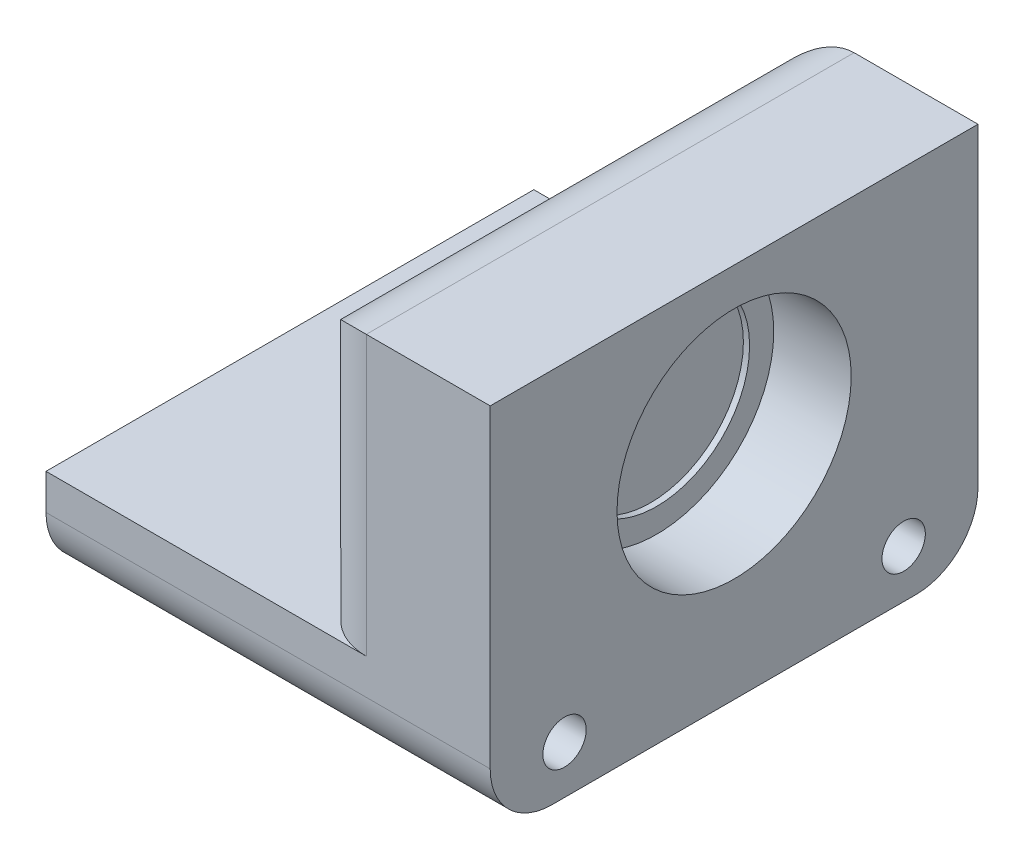
ISO-10303-21;
HEADER;
FILE_DESCRIPTION(('STEP AP214'),'2;1');
FILE_NAME('part.step','',(''),(''),'','','');
FILE_SCHEMA(('AUTOMOTIVE_DESIGN { 1 0 10303 214 1 1 1 1 }'));
ENDSEC;
DATA;
#1=APPLICATION_CONTEXT('core data for automotive mechanical design processes');
#2=APPLICATION_PROTOCOL_DEFINITION('international standard','automotive_design',2000,#1);
#3=PRODUCT_CONTEXT('',#1,'mechanical');
#4=PRODUCT('Part','Part','',(#3));
#5=PRODUCT_RELATED_PRODUCT_CATEGORY('part','',(#4));
#6=PRODUCT_DEFINITION_FORMATION('','',#4);
#7=PRODUCT_DEFINITION_CONTEXT('part definition',#1,'design');
#8=PRODUCT_DEFINITION('design','',#6,#7);
#9=PRODUCT_DEFINITION_SHAPE('','',#8);
#10=(LENGTH_UNIT() NAMED_UNIT(*) SI_UNIT(.MILLI.,.METRE.));
#11=(NAMED_UNIT(*) PLANE_ANGLE_UNIT() SI_UNIT($,.RADIAN.));
#12=(NAMED_UNIT(*) SI_UNIT($,.STERADIAN.) SOLID_ANGLE_UNIT());
#13=UNCERTAINTY_MEASURE_WITH_UNIT(LENGTH_MEASURE(1.E-05),#10,'distance_accuracy_value','');
#14=(GEOMETRIC_REPRESENTATION_CONTEXT(3) GLOBAL_UNCERTAINTY_ASSIGNED_CONTEXT((#13)) GLOBAL_UNIT_ASSIGNED_CONTEXT((#10,
#11,#12)) REPRESENTATION_CONTEXT('',''));
#15=CARTESIAN_POINT('',(0.,0.,0.));
#16=DIRECTION('',(0.,0.,1.));
#17=DIRECTION('',(1.,0.,0.));
#18=AXIS2_PLACEMENT_3D('',#15,#16,#17);
#19=CARTESIAN_POINT('',(-61.1504901312249,0.,-20.));
#20=DIRECTION('',(0.,1.,0.));
#21=DIRECTION('',(-1.,0.,0.));
#22=AXIS2_PLACEMENT_3D('',#19,#20,#21);
#23=PLANE('',#22);
#24=DIRECTION('',(-1.,0.,0.));
#25=VECTOR('',#24,1.);
#26=CARTESIAN_POINT('',(-61.1504901312249,0.,0.));
#27=LINE('',#26,#25);
#28=CARTESIAN_POINT('',(-58.6104901312249,0.,0.));
#29=VERTEX_POINT('',#28);
#30=CARTESIAN_POINT('',(-71.742285041225,0.,0.));
#31=VERTEX_POINT('',#30);
#32=EDGE_CURVE('E152',#29,#31,#27,.T.);
#33=ORIENTED_EDGE('',*,*,#32,.F.);
#34=CARTESIAN_POINT('',(-58.6104901312249,0.,-2.54));
#35=DIRECTION('',(0.,1.,0.));
#36=DIRECTION('',(-1.,0.,0.));
#37=AXIS2_PLACEMENT_3D('',#34,#35,#36);
#38=CIRCLE('',#37,2.54);
#39=CARTESIAN_POINT('',(-61.1504901312249,0.,-2.54));
#40=VERTEX_POINT('',#39);
#41=EDGE_CURVE('E11',#29,#40,#38,.F.);
#42=ORIENTED_EDGE('',*,*,#41,.T.);
#43=DIRECTION('',(0.,0.,1.));
#44=VECTOR('',#43,1.);
#45=CARTESIAN_POINT('',(-61.1504901312249,0.,-20.));
#46=LINE('',#45,#44);
#47=CARTESIAN_POINT('',(-61.1504901312249,0.,-17.46));
#48=VERTEX_POINT('',#47);
#49=EDGE_CURVE('E157',#48,#40,#46,.T.);
#50=ORIENTED_EDGE('',*,*,#49,.F.);
#51=CARTESIAN_POINT('',(-58.6104901312249,0.,-17.46));
#52=DIRECTION('',(0.,1.,0.));
#53=DIRECTION('',(-1.,0.,0.));
#54=AXIS2_PLACEMENT_3D('',#51,#52,#53);
#55=CIRCLE('',#54,2.54);
#56=CARTESIAN_POINT('',(-58.6104901312249,0.,-20.));
#57=VERTEX_POINT('',#56);
#58=EDGE_CURVE('E42',#48,#57,#55,.F.);
#59=ORIENTED_EDGE('',*,*,#58,.T.);
#60=DIRECTION('',(-1.,0.,0.));
#61=VECTOR('',#60,1.);
#62=CARTESIAN_POINT('',(-61.1504901312249,0.,-20.));
#63=LINE('',#62,#61);
#64=CARTESIAN_POINT('',(-71.742285041225,0.,-20.));
#65=VERTEX_POINT('',#64);
#66=EDGE_CURVE('E131',#57,#65,#63,.T.);
#67=ORIENTED_EDGE('',*,*,#66,.T.);
#68=DIRECTION('',(0.,0.,1.));
#69=VECTOR('',#68,1.);
#70=CARTESIAN_POINT('',(-71.742285041225,0.,-20.));
#71=LINE('',#70,#69);
#72=EDGE_CURVE('E117',#65,#31,#71,.T.);
#73=ORIENTED_EDGE('',*,*,#72,.T.);
#74=EDGE_LOOP('',(#33,#42,#50,#59,#67,#73));
#75=FACE_BOUND('',#74,.T.);
#76=ADVANCED_FACE('F33',(#75),#23,.T.);
#77=CARTESIAN_POINT('',(-61.1504901312249,11.43,-20.));
#78=DIRECTION('',(-1.,0.,0.));
#79=DIRECTION('',(0.,0.,1.));
#80=AXIS2_PLACEMENT_3D('',#77,#78,#79);
#81=PLANE('',#80);
#82=DIRECTION('',(0.,0.,1.));
#83=VECTOR('',#82,1.);
#84=CARTESIAN_POINT('',(-61.1504901312249,8.88999999999999,-20.));
#85=LINE('',#84,#83);
#86=CARTESIAN_POINT('',(-61.1504901312249,8.88999999999999,-12.9205582274627));
#87=VERTEX_POINT('',#86);
#88=CARTESIAN_POINT('',(-61.1504901312249,8.88999999999999,-17.46));
#89=VERTEX_POINT('',#88);
#90=EDGE_CURVE('E170',#87,#89,#85,.F.);
#91=ORIENTED_EDGE('',*,*,#90,.T.);
#92=DIRECTION('',(0.,-1.,0.));
#93=VECTOR('',#92,1.);
#94=CARTESIAN_POINT('',(-61.1504901312249,0.,-17.46));
#95=LINE('',#94,#93);
#96=EDGE_CURVE('E172',#89,#48,#95,.T.);
#97=ORIENTED_EDGE('',*,*,#96,.T.);
#98=ORIENTED_EDGE('',*,*,#49,.T.);
#99=DIRECTION('',(0.,-1.,0.));
#100=VECTOR('',#99,1.);
#101=CARTESIAN_POINT('',(-61.1504901312249,11.43,-2.54));
#102=LINE('',#101,#100);
#103=CARTESIAN_POINT('',(-61.1504901312249,8.88999999999999,-2.54));
#104=VERTEX_POINT('',#103);
#105=EDGE_CURVE('E160',#40,#104,#102,.F.);
#106=ORIENTED_EDGE('',*,*,#105,.T.);
#107=DIRECTION('',(0.,0.,1.));
#108=VECTOR('',#107,1.);
#109=CARTESIAN_POINT('',(-61.1504901312249,8.88999999999999,-20.));
#110=LINE('',#109,#108);
#111=CARTESIAN_POINT('',(-61.1504901312249,8.88999999999999,-7.07944177253729));
#112=VERTEX_POINT('',#111);
#113=EDGE_CURVE('E168',#104,#112,#110,.F.);
#114=ORIENTED_EDGE('',*,*,#113,.T.);
#115=CARTESIAN_POINT('',(-61.1504901312249,5.08,-10.));
#116=DIRECTION('',(-1.,0.,0.));
#117=DIRECTION('',(0.,0.,1.));
#118=AXIS2_PLACEMENT_3D('',#115,#116,#117);
#119=CIRCLE('',#118,4.8006);
#120=EDGE_CURVE('E293',#87,#112,#119,.T.);
#121=ORIENTED_EDGE('',*,*,#120,.F.);
#122=EDGE_LOOP('',(#91,#97,#98,#106,#114,#121));
#123=FACE_BOUND('',#122,.T.);
#124=ADVANCED_FACE('F223',(#123),#81,.T.);
#125=CARTESIAN_POINT('',(-53.530479711225,11.43,-20.));
#126=DIRECTION('',(0.,1.,0.));
#127=DIRECTION('',(0.,0.,1.));
#128=AXIS2_PLACEMENT_3D('',#125,#126,#127);
#129=PLANE('',#128);
#130=DIRECTION('',(-1.,0.,0.));
#131=VECTOR('',#130,1.);
#132=CARTESIAN_POINT('',(-53.530479711225,11.43,-20.));
#133=LINE('',#132,#131);
#134=CARTESIAN_POINT('',(-53.530479711225,11.43,-20.));
#135=VERTEX_POINT('',#134);
#136=CARTESIAN_POINT('',(-58.6104901312249,11.43,-20.));
#137=VERTEX_POINT('',#136);
#138=EDGE_CURVE('E127',#135,#137,#133,.T.);
#139=ORIENTED_EDGE('',*,*,#138,.T.);
#140=DIRECTION('',(0.,0.,1.));
#141=VECTOR('',#140,1.);
#142=CARTESIAN_POINT('',(-58.6104901312249,11.43,-20.));
#143=LINE('',#142,#141);
#144=CARTESIAN_POINT('',(-58.6104901312249,11.43,0.));
#145=VERTEX_POINT('',#144);
#146=EDGE_CURVE('E178',#137,#145,#143,.T.);
#147=ORIENTED_EDGE('',*,*,#146,.T.);
#148=DIRECTION('',(-1.,0.,0.));
#149=VECTOR('',#148,1.);
#150=CARTESIAN_POINT('',(-53.530479711225,11.43,0.));
#151=LINE('',#150,#149);
#152=CARTESIAN_POINT('',(-53.530479711225,11.43,0.));
#153=VERTEX_POINT('',#152);
#154=EDGE_CURVE('E140',#153,#145,#151,.T.);
#155=ORIENTED_EDGE('',*,*,#154,.F.);
#156=DIRECTION('',(0.,0.,1.));
#157=VECTOR('',#156,1.);
#158=CARTESIAN_POINT('',(-53.530479711225,11.43,-20.));
#159=LINE('',#158,#157);
#160=EDGE_CURVE('E161',#135,#153,#159,.T.);
#161=ORIENTED_EDGE('',*,*,#160,.F.);
#162=EDGE_LOOP('',(#139,#147,#155,#161));
#163=FACE_BOUND('',#162,.T.);
#164=ADVANCED_FACE('F226',(#163),#129,.T.);
#165=CARTESIAN_POINT('',(-53.530479711225,-4.00000000000001,-20.));
#166=DIRECTION('',(1.,0.,0.));
#167=DIRECTION('',(0.,0.,-1.));
#168=AXIS2_PLACEMENT_3D('',#165,#166,#167);
#169=PLANE('',#168);
#170=CARTESIAN_POINT('',(-53.530479711225,-2.03200000000001,-16.952));
#171=DIRECTION('',(-1.,0.,0.));
#172=DIRECTION('',(0.,0.,1.));
#173=AXIS2_PLACEMENT_3D('',#170,#171,#172);
#174=CIRCLE('',#173,0.888999999999995);
#175=CARTESIAN_POINT('',(-53.530479711225,-2.03200000000001,-16.063));
#176=VERTEX_POINT('',#175);
#177=EDGE_CURVE('E346',#176,#176,#174,.T.);
#178=ORIENTED_EDGE('',*,*,#177,.T.);
#179=EDGE_LOOP('',(#178));
#180=FACE_BOUND('',#179,.T.);
#181=CARTESIAN_POINT('',(-53.530479711225,-2.03200000000001,-3.048));
#182=DIRECTION('',(-1.,0.,0.));
#183=DIRECTION('',(0.,0.,1.));
#184=AXIS2_PLACEMENT_3D('',#181,#182,#183);
#185=CIRCLE('',#184,0.888999999999995);
#186=CARTESIAN_POINT('',(-53.530479711225,-2.03200000000001,-2.159));
#187=VERTEX_POINT('',#186);
#188=EDGE_CURVE('E332',#187,#187,#185,.T.);
#189=ORIENTED_EDGE('',*,*,#188,.T.);
#190=EDGE_LOOP('',(#189));
#191=FACE_BOUND('',#190,.T.);
#192=CARTESIAN_POINT('',(-53.530479711225,5.08,-10.));
#193=DIRECTION('',(1.,0.,0.));
#194=DIRECTION('',(0.,0.,-1.));
#195=AXIS2_PLACEMENT_3D('',#192,#193,#194);
#196=CIRCLE('',#195,4.8006);
#197=CARTESIAN_POINT('',(-53.530479711225,5.08,-14.8006));
#198=VERTEX_POINT('',#197);
#199=EDGE_CURVE('E323',#198,#198,#196,.T.);
#200=ORIENTED_EDGE('',*,*,#199,.F.);
#201=EDGE_LOOP('',(#200));
#202=FACE_BOUND('',#201,.T.);
#203=DIRECTION('',(0.,1.,0.));
#204=VECTOR('',#203,1.);
#205=CARTESIAN_POINT('',(-53.530479711225,-4.00000000000001,0.));
#206=LINE('',#205,#204);
#207=CARTESIAN_POINT('',(-53.530479711225,-1.46000000000001,0.));
#208=VERTEX_POINT('',#207);
#209=EDGE_CURVE('E143',#208,#153,#206,.T.);
#210=ORIENTED_EDGE('',*,*,#209,.F.);
#211=CARTESIAN_POINT('',(-53.530479711225,-1.46000000000001,-2.54));
#212=DIRECTION('',(1.,0.,0.));
#213=DIRECTION('',(0.,0.,-1.));
#214=AXIS2_PLACEMENT_3D('',#211,#212,#213);
#215=CIRCLE('',#214,2.54);
#216=CARTESIAN_POINT('',(-53.530479711225,-4.00000000000001,-2.54));
#217=VERTEX_POINT('',#216);
#218=EDGE_CURVE('E270',#208,#217,#215,.T.);
#219=ORIENTED_EDGE('',*,*,#218,.T.);
#220=DIRECTION('',(0.,0.,1.));
#221=VECTOR('',#220,1.);
#222=CARTESIAN_POINT('',(-53.530479711225,-4.00000000000001,-20.));
#223=LINE('',#222,#221);
#224=CARTESIAN_POINT('',(-53.530479711225,-4.00000000000001,-17.46));
#225=VERTEX_POINT('',#224);
#226=EDGE_CURVE('E164',#225,#217,#223,.T.);
#227=ORIENTED_EDGE('',*,*,#226,.F.);
#228=CARTESIAN_POINT('',(-53.530479711225,-1.46000000000001,-17.46));
#229=DIRECTION('',(1.,0.,0.));
#230=DIRECTION('',(0.,0.,-1.));
#231=AXIS2_PLACEMENT_3D('',#228,#229,#230);
#232=CIRCLE('',#231,2.54);
#233=CARTESIAN_POINT('',(-53.530479711225,-1.46000000000001,-20.));
#234=VERTEX_POINT('',#233);
#235=EDGE_CURVE('E272',#225,#234,#232,.T.);
#236=ORIENTED_EDGE('',*,*,#235,.T.);
#237=DIRECTION('',(0.,1.,0.));
#238=VECTOR('',#237,1.);
#239=CARTESIAN_POINT('',(-53.530479711225,-4.00000000000001,-20.));
#240=LINE('',#239,#238);
#241=EDGE_CURVE('E136',#234,#135,#240,.T.);
#242=ORIENTED_EDGE('',*,*,#241,.T.);
#243=ORIENTED_EDGE('',*,*,#160,.T.);
#244=EDGE_LOOP('',(#210,#219,#227,#236,#242,#243));
#245=FACE_BOUND('',#244,.T.);
#246=ADVANCED_FACE('F230',(#180,#191,#202,#245),#169,.T.);
#247=CARTESIAN_POINT('',(-71.742285041225,-4.00000000000001,-20.));
#248=DIRECTION('',(0.,-1.,0.));
#249=DIRECTION('',(1.,0.,0.));
#250=AXIS2_PLACEMENT_3D('',#247,#248,#249);
#251=PLANE('',#250);
#252=ORIENTED_EDGE('',*,*,#226,.T.);
#253=DIRECTION('',(1.,0.,0.));
#254=VECTOR('',#253,1.);
#255=CARTESIAN_POINT('',(-71.742285041225,-4.00000000000001,-2.54));
#256=LINE('',#255,#254);
#257=CARTESIAN_POINT('',(-71.742285041225,-4.00000000000001,-2.54));
#258=VERTEX_POINT('',#257);
#259=EDGE_CURVE('E50',#217,#258,#256,.F.);
#260=ORIENTED_EDGE('',*,*,#259,.T.);
#261=DIRECTION('',(0.,0.,1.));
#262=VECTOR('',#261,1.);
#263=CARTESIAN_POINT('',(-71.742285041225,-4.00000000000001,-20.));
#264=LINE('',#263,#262);
#265=CARTESIAN_POINT('',(-71.742285041225,-4.00000000000001,-17.46));
#266=VERTEX_POINT('',#265);
#267=EDGE_CURVE('E126',#266,#258,#264,.T.);
#268=ORIENTED_EDGE('',*,*,#267,.F.);
#269=DIRECTION('',(1.,0.,0.));
#270=VECTOR('',#269,1.);
#271=CARTESIAN_POINT('',(-53.530479711225,-4.00000000000001,-17.46));
#272=LINE('',#271,#270);
#273=EDGE_CURVE('E267',#266,#225,#272,.T.);
#274=ORIENTED_EDGE('',*,*,#273,.T.);
#275=EDGE_LOOP('',(#252,#260,#268,#274));
#276=FACE_BOUND('',#275,.T.);
#277=ADVANCED_FACE('F234',(#276),#251,.T.);
#278=CARTESIAN_POINT('',(-71.742285041225,0.,-20.));
#279=DIRECTION('',(-1.,0.,0.));
#280=DIRECTION('',(0.,0.,1.));
#281=AXIS2_PLACEMENT_3D('',#278,#279,#280);
#282=PLANE('',#281);
#283=CARTESIAN_POINT('',(-71.742285041225,-2.03200000000001,-16.952));
#284=DIRECTION('',(-1.,0.,0.));
#285=DIRECTION('',(0.,0.,1.));
#286=AXIS2_PLACEMENT_3D('',#283,#284,#285);
#287=CIRCLE('',#286,1.5875);
#288=CARTESIAN_POINT('',(-71.742285041225,-2.03200000000001,-15.3645));
#289=VERTEX_POINT('',#288);
#290=EDGE_CURVE('E260',#289,#289,#287,.T.);
#291=ORIENTED_EDGE('',*,*,#290,.F.);
#292=EDGE_LOOP('',(#291));
#293=FACE_BOUND('',#292,.T.);
#294=CARTESIAN_POINT('',(-71.742285041225,-2.03200000000001,-3.048));
#295=DIRECTION('',(-1.,0.,0.));
#296=DIRECTION('',(0.,0.,1.));
#297=AXIS2_PLACEMENT_3D('',#294,#295,#296);
#298=CIRCLE('',#297,1.5875);
#299=CARTESIAN_POINT('',(-71.742285041225,-2.03200000000001,-1.4605));
#300=VERTEX_POINT('',#299);
#301=EDGE_CURVE('E343',#300,#300,#298,.T.);
#302=ORIENTED_EDGE('',*,*,#301,.F.);
#303=EDGE_LOOP('',(#302));
#304=FACE_BOUND('',#303,.T.);
#305=CARTESIAN_POINT('',(-71.742285041225,-2.00000000000001,-7.714));
#306=DIRECTION('',(-1.,0.,0.));
#307=DIRECTION('',(0.,0.,-1.));
#308=AXIS2_PLACEMENT_3D('',#305,#306,#307);
#309=CIRCLE('',#308,1.27);
#310=CARTESIAN_POINT('',(-71.742285041225,-2.00000000000001,-8.984));
#311=VERTEX_POINT('',#310);
#312=EDGE_CURVE('E299',#311,#311,#309,.T.);
#313=ORIENTED_EDGE('',*,*,#312,.F.);
#314=EDGE_LOOP('',(#313));
#315=FACE_BOUND('',#314,.T.);
#316=CARTESIAN_POINT('',(-71.742285041225,-2.00000000000001,-12.286));
#317=DIRECTION('',(-1.,0.,0.));
#318=DIRECTION('',(0.,0.,1.));
#319=AXIS2_PLACEMENT_3D('',#316,#317,#318);
#320=CIRCLE('',#319,1.27);
#321=CARTESIAN_POINT('',(-71.742285041225,-2.00000000000001,-11.016));
#322=VERTEX_POINT('',#321);
#323=EDGE_CURVE('E146',#322,#322,#320,.T.);
#324=ORIENTED_EDGE('',*,*,#323,.F.);
#325=EDGE_LOOP('',(#324));
#326=FACE_BOUND('',#325,.T.);
#327=ORIENTED_EDGE('',*,*,#267,.T.);
#328=CARTESIAN_POINT('',(-71.742285041225,-1.46000000000001,-2.54));
#329=DIRECTION('',(-1.,0.,0.));
#330=DIRECTION('',(0.,0.,1.));
#331=AXIS2_PLACEMENT_3D('',#328,#329,#330);
#332=CIRCLE('',#331,2.54);
#333=CARTESIAN_POINT('',(-71.742285041225,-1.46000000000001,0.));
#334=VERTEX_POINT('',#333);
#335=EDGE_CURVE('E263',#258,#334,#332,.T.);
#336=ORIENTED_EDGE('',*,*,#335,.T.);
#337=DIRECTION('',(0.,-1.,0.));
#338=VECTOR('',#337,1.);
#339=CARTESIAN_POINT('',(-71.742285041225,0.,0.));
#340=LINE('',#339,#338);
#341=EDGE_CURVE('E122',#31,#334,#340,.T.);
#342=ORIENTED_EDGE('',*,*,#341,.F.);
#343=ORIENTED_EDGE('',*,*,#72,.F.);
#344=DIRECTION('',(0.,-1.,0.));
#345=VECTOR('',#344,1.);
#346=CARTESIAN_POINT('',(-71.742285041225,0.,-20.));
#347=LINE('',#346,#345);
#348=CARTESIAN_POINT('',(-71.742285041225,-1.46000000000001,-20.));
#349=VERTEX_POINT('',#348);
#350=EDGE_CURVE('E120',#65,#349,#347,.T.);
#351=ORIENTED_EDGE('',*,*,#350,.T.);
#352=CARTESIAN_POINT('',(-71.742285041225,-1.46000000000001,-17.46));
#353=DIRECTION('',(-1.,0.,0.));
#354=DIRECTION('',(0.,0.,1.));
#355=AXIS2_PLACEMENT_3D('',#352,#353,#354);
#356=CIRCLE('',#355,2.54);
#357=EDGE_CURVE('E57',#349,#266,#356,.T.);
#358=ORIENTED_EDGE('',*,*,#357,.T.);
#359=EDGE_LOOP('',(#327,#336,#342,#343,#351,#358));
#360=FACE_BOUND('',#359,.T.);
#361=ADVANCED_FACE('F119',(#293,#304,#315,#326,#360),#282,.T.);
#362=CARTESIAN_POINT('',(0.,0.,-20.));
#363=DIRECTION('',(0.,0.,1.));
#364=DIRECTION('',(1.,0.,0.));
#365=AXIS2_PLACEMENT_3D('',#362,#363,#364);
#366=PLANE('',#365);
#367=ORIENTED_EDGE('',*,*,#66,.F.);
#368=DIRECTION('',(0.,-1.,0.));
#369=VECTOR('',#368,1.);
#370=CARTESIAN_POINT('',(-58.6104901312249,11.43,-20.));
#371=LINE('',#370,#369);
#372=EDGE_CURVE('E176',#57,#137,#371,.F.);
#373=ORIENTED_EDGE('',*,*,#372,.T.);
#374=ORIENTED_EDGE('',*,*,#138,.F.);
#375=ORIENTED_EDGE('',*,*,#241,.F.);
#376=DIRECTION('',(1.,0.,0.));
#377=VECTOR('',#376,1.);
#378=CARTESIAN_POINT('',(-71.742285041225,-1.46000000000001,-20.));
#379=LINE('',#378,#377);
#380=EDGE_CURVE('E135',#234,#349,#379,.F.);
#381=ORIENTED_EDGE('',*,*,#380,.T.);
#382=ORIENTED_EDGE('',*,*,#350,.F.);
#383=EDGE_LOOP('',(#367,#373,#374,#375,#381,#382));
#384=FACE_BOUND('',#383,.T.);
#385=ADVANCED_FACE('F130',(#384),#366,.F.);
#386=CARTESIAN_POINT('',(0.,0.,0.));
#387=DIRECTION('',(0.,0.,1.));
#388=DIRECTION('',(1.,0.,0.));
#389=AXIS2_PLACEMENT_3D('',#386,#387,#388);
#390=PLANE('',#389);
#391=ORIENTED_EDGE('',*,*,#154,.T.);
#392=DIRECTION('',(0.,-1.,0.));
#393=VECTOR('',#392,1.);
#394=CARTESIAN_POINT('',(-58.6104901312249,0.,0.));
#395=LINE('',#394,#393);
#396=EDGE_CURVE('E273',#145,#29,#395,.T.);
#397=ORIENTED_EDGE('',*,*,#396,.T.);
#398=ORIENTED_EDGE('',*,*,#32,.T.);
#399=ORIENTED_EDGE('',*,*,#341,.T.);
#400=DIRECTION('',(1.,0.,0.));
#401=VECTOR('',#400,1.);
#402=CARTESIAN_POINT('',(0.,-1.46000000000001,0.));
#403=LINE('',#402,#401);
#404=EDGE_CURVE('E187',#334,#208,#403,.T.);
#405=ORIENTED_EDGE('',*,*,#404,.T.);
#406=ORIENTED_EDGE('',*,*,#209,.T.);
#407=EDGE_LOOP('',(#391,#397,#398,#399,#405,#406));
#408=FACE_BOUND('',#407,.T.);
#409=ADVANCED_FACE('F216',(#408),#390,.T.);
#410=CARTESIAN_POINT('',(-67.7422849132249,-2.00000000000001,-12.286));
#411=DIRECTION('',(-1.,0.,0.));
#412=DIRECTION('',(0.,0.,1.));
#413=AXIS2_PLACEMENT_3D('',#410,#411,#412);
#414=CYLINDRICAL_SURFACE('',#413,1.27);
#415=CARTESIAN_POINT('',(-67.7422849132249,-2.00000000000001,-12.286));
#416=DIRECTION('',(-1.,0.,0.));
#417=DIRECTION('',(0.,0.,1.));
#418=AXIS2_PLACEMENT_3D('',#415,#416,#417);
#419=CIRCLE('',#418,1.27);
#420=CARTESIAN_POINT('',(-67.7422849132249,-2.00000000000001,-11.016));
#421=VERTEX_POINT('',#420);
#422=EDGE_CURVE('E154',#421,#421,#419,.T.);
#423=ORIENTED_EDGE('',*,*,#422,.F.);
#424=EDGE_LOOP('',(#423));
#425=FACE_BOUND('',#424,.T.);
#426=ORIENTED_EDGE('',*,*,#323,.T.);
#427=EDGE_LOOP('',(#426));
#428=FACE_BOUND('',#427,.T.);
#429=ADVANCED_FACE('F212',(#425,#428),#414,.F.);
#430=CARTESIAN_POINT('',(-67.7422849132249,-2.00000000000001,-12.286));
#431=DIRECTION('',(-1.,0.,0.));
#432=DIRECTION('',(0.,0.,1.));
#433=AXIS2_PLACEMENT_3D('',#430,#431,#432);
#434=PLANE('',#433);
#435=ORIENTED_EDGE('',*,*,#422,.T.);
#436=EDGE_LOOP('',(#435));
#437=FACE_BOUND('',#436,.T.);
#438=ADVANCED_FACE('F208',(#437),#434,.T.);
#439=CARTESIAN_POINT('',(-67.7422849132249,-2.00000000000001,-7.714));
#440=DIRECTION('',(-1.,0.,0.));
#441=DIRECTION('',(0.,0.,1.));
#442=AXIS2_PLACEMENT_3D('',#439,#440,#441);
#443=CYLINDRICAL_SURFACE('',#442,1.27);
#444=CARTESIAN_POINT('',(-67.7422849132249,-2.00000000000001,-7.714));
#445=DIRECTION('',(-1.,0.,0.));
#446=DIRECTION('',(0.,0.,-1.));
#447=AXIS2_PLACEMENT_3D('',#444,#445,#446);
#448=CIRCLE('',#447,1.27);
#449=CARTESIAN_POINT('',(-67.7422849132249,-2.00000000000001,-8.984));
#450=VERTEX_POINT('',#449);
#451=EDGE_CURVE('E306',#450,#450,#448,.T.);
#452=ORIENTED_EDGE('',*,*,#451,.F.);
#453=EDGE_LOOP('',(#452));
#454=FACE_BOUND('',#453,.T.);
#455=ORIENTED_EDGE('',*,*,#312,.T.);
#456=EDGE_LOOP('',(#455));
#457=FACE_BOUND('',#456,.T.);
#458=ADVANCED_FACE('F204',(#454,#457),#443,.F.);
#459=CARTESIAN_POINT('',(-67.7422849132249,-2.00000000000001,-7.714));
#460=DIRECTION('',(1.,0.,0.));
#461=DIRECTION('',(0.,0.,-1.));
#462=AXIS2_PLACEMENT_3D('',#459,#460,#461);
#463=PLANE('',#462);
#464=ORIENTED_EDGE('',*,*,#451,.T.);
#465=EDGE_LOOP('',(#464));
#466=FACE_BOUND('',#465,.T.);
#467=ADVANCED_FACE('F199',(#466),#463,.F.);
#468=CARTESIAN_POINT('',(-57.975490131225,5.08,-10.));
#469=DIRECTION('',(-1.,0.,0.));
#470=DIRECTION('',(0.,0.,1.));
#471=AXIS2_PLACEMENT_3D('',#468,#469,#470);
#472=CYLINDRICAL_SURFACE('',#471,4.8006);
#473=CARTESIAN_POINT('',(-57.975490131225,5.08,-10.));
#474=DIRECTION('',(-1.,0.,0.));
#475=DIRECTION('',(0.,0.,1.));
#476=AXIS2_PLACEMENT_3D('',#473,#474,#475);
#477=CIRCLE('',#476,4.8006);
#478=CARTESIAN_POINT('',(-57.975490131225,5.08,-5.1994));
#479=VERTEX_POINT('',#478);
#480=EDGE_CURVE('E295',#479,#479,#477,.T.);
#481=ORIENTED_EDGE('',*,*,#480,.F.);
#482=EDGE_LOOP('',(#481));
#483=FACE_BOUND('',#482,.T.);
#484=ORIENTED_EDGE('',*,*,#120,.T.);
#485=CARTESIAN_POINT('',(-61.1504901312249,8.88999999999999,-7.07944177253729));
#486=CARTESIAN_POINT('',(-61.1504752178332,8.95533055933466,-7.16465486263751));
#487=CARTESIAN_POINT('',(-61.147970500377,9.01775733054552,-7.25202763229909));
#488=CARTESIAN_POINT('',(-61.1392049280559,9.13649727920082,-7.43055431752008));
#489=CARTESIAN_POINT('',(-61.1329472655497,9.19281560463351,-7.52170495824394));
#490=CARTESIAN_POINT('',(-61.1178835876985,9.29922584653965,-7.70753758104752));
#491=CARTESIAN_POINT('',(-61.1090736875137,9.34930810348533,-7.80222475335888));
#492=CARTESIAN_POINT('',(-61.0900224610862,9.44299729773194,-7.99464011903791));
#493=CARTESIAN_POINT('',(-61.0797806876902,9.48660220344173,-8.09236925492731));
#494=CARTESIAN_POINT('',(-61.0570603395345,9.57432250350141,-8.30805579340597));
#495=CARTESIAN_POINT('',(-61.0445070869639,9.61715816825431,-8.42652800017256));
#496=CARTESIAN_POINT('',(-61.0204130495658,9.69341247685897,-8.66656671948753));
#497=CARTESIAN_POINT('',(-61.0088722751112,9.72683102423846,-8.78813326372149));
#498=CARTESIAN_POINT('',(-60.9881537090481,9.78400324273012,-9.03357842216891));
#499=CARTESIAN_POINT('',(-60.9789732320758,9.80776791529657,-9.15745423536281));
#500=CARTESIAN_POINT('',(-60.9640090983754,9.84549033497826,-9.40689635281039));
#501=CARTESIAN_POINT('',(-60.9582253565159,9.85944832787701,-9.53246261461617));
#502=CARTESIAN_POINT('',(-60.95054200197,9.87785920164709,-9.7905886396795));
#503=CARTESIAN_POINT('',(-60.9488458135577,9.88181473609463,-9.92319053286943));
#504=CARTESIAN_POINT('',(-60.950147791181,9.87873851556006,-10.188248698755));
#505=CARTESIAN_POINT('',(-60.9531462335266,9.87170611386549,-10.3207049624201));
#506=CARTESIAN_POINT('',(-60.9634627026244,9.84671369411663,-10.5846415326543));
#507=CARTESIAN_POINT('',(-60.9707883539776,9.82873438573997,-10.716119700719));
#508=CARTESIAN_POINT('',(-60.9888357039458,9.7820181873966,-10.9769004531179));
#509=CARTESIAN_POINT('',(-60.9995573154503,9.75328157336463,-11.1062030931676));
#510=CARTESIAN_POINT('',(-61.0225436926895,9.68673113912334,-11.3564045625824));
#511=CARTESIAN_POINT('',(-61.0347240290275,9.64935256149428,-11.4774275443442));
#512=CARTESIAN_POINT('',(-61.0595040038973,9.56517041506422,-11.716105782091));
#513=CARTESIAN_POINT('',(-61.0721036392206,9.51836691837115,-11.8337610638336));
#514=CARTESIAN_POINT('',(-61.0960509733243,9.41569806505787,-12.0648060067641));
#515=CARTESIAN_POINT('',(-61.1074018859541,9.35985693086788,-12.1782060985767));
#516=CARTESIAN_POINT('',(-61.1270980504909,9.23930146843172,-12.4004014378086));
#517=CARTESIAN_POINT('',(-61.1354453321816,9.17459317339159,-12.5091997509619));
#518=CARTESIAN_POINT('',(-61.1442106625589,9.07170971053745,-12.6675633948192));
#519=CARTESIAN_POINT('',(-61.1465026036923,9.03675637278427,-12.719139827191));
#520=CARTESIAN_POINT('',(-61.1496413594641,8.96485909008879,-12.82090605461));
#521=CARTESIAN_POINT('',(-61.1504886217203,8.92791576538303,-12.8710962744163));
#522=CARTESIAN_POINT('',(-61.1504901312249,8.88999999999999,-12.9205582274627));
#523=B_SPLINE_CURVE_WITH_KNOTS('',3,(#485,#486,#487,#488,#489,#490,#491,#492,#493,#494,#495,
#496,#497,#498,#499,#500,#501,#502,#503,#504,#505,#506,#507,#508,#509,#510,#511,#512,#513,#514,
#515,#516,#517,#518,#519,#520,#521,#522),.UNSPECIFIED.,.F.,.F.,(4,2,2,2,2,2,2,2,2,2,2,2,2,2,2,2,
2,2,4),(0.,0.321960568256824,0.643647655628667,0.965826988920784,1.28810715986738,
1.66751696424481,2.04693065528975,2.42591074928112,2.80488134460572,3.20235466108616,
3.59985137237208,3.99805057633738,4.39623956682874,4.77759005483418,5.15893762532421,
5.53927954765867,5.91936395895913,6.10634826304371,6.29327462157247),.UNSPECIFIED.);
#524=EDGE_CURVE('E180',#112,#87,#523,.T.);
#525=ORIENTED_EDGE('',*,*,#524,.T.);
#526=EDGE_LOOP('',(#484,#525));
#527=FACE_BOUND('',#526,.T.);
#528=ADVANCED_FACE('F193',(#483,#527),#472,.F.);
#529=CARTESIAN_POINT('',(-57.975490131225,5.08,-10.));
#530=DIRECTION('',(-1.,0.,0.));
#531=DIRECTION('',(0.,0.,1.));
#532=AXIS2_PLACEMENT_3D('',#529,#530,#531);
#533=PLANE('',#532);
#534=CARTESIAN_POINT('',(-57.975490131225,5.08,-10.));
#535=DIRECTION('',(-1.,0.,0.));
#536=DIRECTION('',(0.,0.,1.));
#537=AXIS2_PLACEMENT_3D('',#534,#535,#536);
#538=CIRCLE('',#537,3.81);
#539=CARTESIAN_POINT('',(-57.975490131225,5.08,-6.19));
#540=VERTEX_POINT('',#539);
#541=EDGE_CURVE('E302',#540,#540,#538,.T.);
#542=ORIENTED_EDGE('',*,*,#541,.F.);
#543=EDGE_LOOP('',(#542));
#544=FACE_BOUND('',#543,.T.);
#545=ORIENTED_EDGE('',*,*,#480,.T.);
#546=EDGE_LOOP('',(#545));
#547=FACE_BOUND('',#546,.T.);
#548=ADVANCED_FACE('F198',(#544,#547),#533,.T.);
#549=CARTESIAN_POINT('',(-57.721490131225,5.08,-10.));
#550=DIRECTION('',(-1.,0.,0.));
#551=DIRECTION('',(0.,0.,1.));
#552=AXIS2_PLACEMENT_3D('',#549,#550,#551);
#553=CYLINDRICAL_SURFACE('',#552,3.81);
#554=CARTESIAN_POINT('',(-57.721490131225,5.08,-10.));
#555=DIRECTION('',(-1.,0.,0.));
#556=DIRECTION('',(0.,0.,1.));
#557=AXIS2_PLACEMENT_3D('',#554,#555,#556);
#558=CIRCLE('',#557,3.81);
#559=CARTESIAN_POINT('',(-57.721490131225,5.08,-6.19));
#560=VERTEX_POINT('',#559);
#561=EDGE_CURVE('E296',#560,#560,#558,.T.);
#562=ORIENTED_EDGE('',*,*,#561,.F.);
#563=EDGE_LOOP('',(#562));
#564=FACE_BOUND('',#563,.T.);
#565=ORIENTED_EDGE('',*,*,#541,.T.);
#566=EDGE_LOOP('',(#565));
#567=FACE_BOUND('',#566,.T.);
#568=ADVANCED_FACE('F402',(#564,#567),#553,.F.);
#569=CARTESIAN_POINT('',(-57.721490131225,5.08,-10.));
#570=DIRECTION('',(-1.,0.,0.));
#571=DIRECTION('',(0.,0.,1.));
#572=AXIS2_PLACEMENT_3D('',#569,#570,#571);
#573=PLANE('',#572);
#574=ORIENTED_EDGE('',*,*,#561,.T.);
#575=EDGE_LOOP('',(#574));
#576=FACE_BOUND('',#575,.T.);
#577=ADVANCED_FACE('F399',(#576),#573,.T.);
#578=CARTESIAN_POINT('',(-56.705479711225,5.08,-10.));
#579=DIRECTION('',(1.,0.,0.));
#580=DIRECTION('',(0.,0.,-1.));
#581=AXIS2_PLACEMENT_3D('',#578,#579,#580);
#582=CYLINDRICAL_SURFACE('',#581,4.8006);
#583=CARTESIAN_POINT('',(-56.705479711225,5.08,-10.));
#584=DIRECTION('',(1.,0.,0.));
#585=DIRECTION('',(0.,0.,-1.));
#586=AXIS2_PLACEMENT_3D('',#583,#584,#585);
#587=CIRCLE('',#586,4.8006);
#588=CARTESIAN_POINT('',(-56.705479711225,5.08,-14.8006));
#589=VERTEX_POINT('',#588);
#590=EDGE_CURVE('E321',#589,#589,#587,.T.);
#591=ORIENTED_EDGE('',*,*,#590,.F.);
#592=EDGE_LOOP('',(#591));
#593=FACE_BOUND('',#592,.T.);
#594=ORIENTED_EDGE('',*,*,#199,.T.);
#595=EDGE_LOOP('',(#594));
#596=FACE_BOUND('',#595,.T.);
#597=ADVANCED_FACE('F395',(#593,#596),#582,.F.);
#598=CARTESIAN_POINT('',(-56.705479711225,5.08,-10.));
#599=DIRECTION('',(1.,0.,0.));
#600=DIRECTION('',(0.,0.,-1.));
#601=AXIS2_PLACEMENT_3D('',#598,#599,#600);
#602=PLANE('',#601);
#603=CARTESIAN_POINT('',(-56.705479711225,5.08,-10.));
#604=DIRECTION('',(1.,0.,0.));
#605=DIRECTION('',(0.,0.,-1.));
#606=AXIS2_PLACEMENT_3D('',#603,#604,#605);
#607=CIRCLE('',#606,3.81);
#608=CARTESIAN_POINT('',(-56.705479711225,5.08,-13.81));
#609=VERTEX_POINT('',#608);
#610=EDGE_CURVE('E329',#609,#609,#607,.T.);
#611=ORIENTED_EDGE('',*,*,#610,.F.);
#612=EDGE_LOOP('',(#611));
#613=FACE_BOUND('',#612,.T.);
#614=ORIENTED_EDGE('',*,*,#590,.T.);
#615=EDGE_LOOP('',(#614));
#616=FACE_BOUND('',#615,.T.);
#617=ADVANCED_FACE('F391',(#613,#616),#602,.T.);
#618=CARTESIAN_POINT('',(-56.959479711225,5.08,-10.));
#619=DIRECTION('',(1.,0.,0.));
#620=DIRECTION('',(0.,0.,-1.));
#621=AXIS2_PLACEMENT_3D('',#618,#619,#620);
#622=CYLINDRICAL_SURFACE('',#621,3.81);
#623=CARTESIAN_POINT('',(-56.959479711225,5.08,-10.));
#624=DIRECTION('',(1.,0.,0.));
#625=DIRECTION('',(0.,0.,-1.));
#626=AXIS2_PLACEMENT_3D('',#623,#624,#625);
#627=CIRCLE('',#626,3.81);
#628=CARTESIAN_POINT('',(-56.959479711225,5.08,-13.81));
#629=VERTEX_POINT('',#628);
#630=EDGE_CURVE('E326',#629,#629,#627,.T.);
#631=ORIENTED_EDGE('',*,*,#630,.F.);
#632=EDGE_LOOP('',(#631));
#633=FACE_BOUND('',#632,.T.);
#634=ORIENTED_EDGE('',*,*,#610,.T.);
#635=EDGE_LOOP('',(#634));
#636=FACE_BOUND('',#635,.T.);
#637=ADVANCED_FACE('F387',(#633,#636),#622,.F.);
#638=CARTESIAN_POINT('',(-56.959479711225,5.08,-10.));
#639=DIRECTION('',(1.,0.,0.));
#640=DIRECTION('',(0.,0.,-1.));
#641=AXIS2_PLACEMENT_3D('',#638,#639,#640);
#642=PLANE('',#641);
#643=ORIENTED_EDGE('',*,*,#630,.T.);
#644=EDGE_LOOP('',(#643));
#645=FACE_BOUND('',#644,.T.);
#646=ADVANCED_FACE('F383',(#645),#642,.T.);
#647=CARTESIAN_POINT('',(-71.742285041225,-2.03200000000001,-3.048));
#648=DIRECTION('',(-1.,0.,0.));
#649=DIRECTION('',(0.,0.,1.));
#650=AXIS2_PLACEMENT_3D('',#647,#648,#649);
#651=CYLINDRICAL_SURFACE('',#650,0.888999999999996);
#652=ORIENTED_EDGE('',*,*,#188,.F.);
#653=EDGE_LOOP('',(#652));
#654=FACE_BOUND('',#653,.T.);
#655=CARTESIAN_POINT('',(-57.010285041225,-2.03200000000001,-3.048));
#656=DIRECTION('',(-1.,0.,0.));
#657=DIRECTION('',(0.,0.,1.));
#658=AXIS2_PLACEMENT_3D('',#655,#656,#657);
#659=CIRCLE('',#658,0.888999999999997);
#660=CARTESIAN_POINT('',(-57.010285041225,-2.03200000000001,-2.159));
#661=VERTEX_POINT('',#660);
#662=EDGE_CURVE('E337',#661,#661,#659,.T.);
#663=ORIENTED_EDGE('',*,*,#662,.T.);
#664=EDGE_LOOP('',(#663));
#665=FACE_BOUND('',#664,.T.);
#666=ADVANCED_FACE('F375',(#654,#665),#651,.F.);
#667=CARTESIAN_POINT('',(-57.010285041225,-1.14300000000001,-3.048));
#668=DIRECTION('',(1.,0.,0.));
#669=DIRECTION('',(0.,0.,-1.));
#670=AXIS2_PLACEMENT_3D('',#667,#668,#669);
#671=PLANE('',#670);
#672=ORIENTED_EDGE('',*,*,#662,.F.);
#673=EDGE_LOOP('',(#672));
#674=FACE_BOUND('',#673,.T.);
#675=CARTESIAN_POINT('',(-57.010285041225,-2.03200000000001,-3.048));
#676=DIRECTION('',(-1.,0.,0.));
#677=DIRECTION('',(0.,0.,1.));
#678=AXIS2_PLACEMENT_3D('',#675,#676,#677);
#679=CIRCLE('',#678,1.5875);
#680=CARTESIAN_POINT('',(-57.010285041225,-2.03200000000001,-1.4605));
#681=VERTEX_POINT('',#680);
#682=EDGE_CURVE('E340',#681,#681,#679,.T.);
#683=ORIENTED_EDGE('',*,*,#682,.T.);
#684=EDGE_LOOP('',(#683));
#685=FACE_BOUND('',#684,.T.);
#686=ADVANCED_FACE('F365',(#674,#685),#671,.F.);
#687=CARTESIAN_POINT('',(-71.742285041225,-2.03200000000001,-3.048));
#688=DIRECTION('',(-1.,0.,0.));
#689=DIRECTION('',(0.,0.,1.));
#690=AXIS2_PLACEMENT_3D('',#687,#688,#689);
#691=CYLINDRICAL_SURFACE('',#690,1.5875);
#692=ORIENTED_EDGE('',*,*,#682,.F.);
#693=EDGE_LOOP('',(#692));
#694=FACE_BOUND('',#693,.T.);
#695=ORIENTED_EDGE('',*,*,#301,.T.);
#696=EDGE_LOOP('',(#695));
#697=FACE_BOUND('',#696,.T.);
#698=ADVANCED_FACE('F362',(#694,#697),#691,.F.);
#699=CARTESIAN_POINT('',(-71.742285041225,-2.03200000000001,-16.952));
#700=DIRECTION('',(-1.,0.,0.));
#701=DIRECTION('',(0.,0.,1.));
#702=AXIS2_PLACEMENT_3D('',#699,#700,#701);
#703=CYLINDRICAL_SURFACE('',#702,0.888999999999996);
#704=ORIENTED_EDGE('',*,*,#177,.F.);
#705=EDGE_LOOP('',(#704));
#706=FACE_BOUND('',#705,.T.);
#707=CARTESIAN_POINT('',(-57.010285041225,-2.03200000000001,-16.952));
#708=DIRECTION('',(-1.,0.,0.));
#709=DIRECTION('',(0.,0.,1.));
#710=AXIS2_PLACEMENT_3D('',#707,#708,#709);
#711=CIRCLE('',#710,0.888999999999997);
#712=CARTESIAN_POINT('',(-57.010285041225,-2.03200000000001,-16.063));
#713=VERTEX_POINT('',#712);
#714=EDGE_CURVE('E349',#713,#713,#711,.T.);
#715=ORIENTED_EDGE('',*,*,#714,.T.);
#716=EDGE_LOOP('',(#715));
#717=FACE_BOUND('',#716,.T.);
#718=ADVANCED_FACE('F364',(#706,#717),#703,.F.);
#719=CARTESIAN_POINT('',(-57.010285041225,-1.14300000000001,-16.952));
#720=DIRECTION('',(1.,0.,0.));
#721=DIRECTION('',(0.,0.,-1.));
#722=AXIS2_PLACEMENT_3D('',#719,#720,#721);
#723=PLANE('',#722);
#724=ORIENTED_EDGE('',*,*,#714,.F.);
#725=EDGE_LOOP('',(#724));
#726=FACE_BOUND('',#725,.T.);
#727=CARTESIAN_POINT('',(-57.010285041225,-2.03200000000001,-16.952));
#728=DIRECTION('',(-1.,0.,0.));
#729=DIRECTION('',(0.,0.,1.));
#730=AXIS2_PLACEMENT_3D('',#727,#728,#729);
#731=CIRCLE('',#730,1.5875);
#732=CARTESIAN_POINT('',(-57.010285041225,-2.03200000000001,-15.3645));
#733=VERTEX_POINT('',#732);
#734=EDGE_CURVE('E352',#733,#733,#731,.T.);
#735=ORIENTED_EDGE('',*,*,#734,.T.);
#736=EDGE_LOOP('',(#735));
#737=FACE_BOUND('',#736,.T.);
#738=ADVANCED_FACE('F372',(#726,#737),#723,.F.);
#739=CARTESIAN_POINT('',(-71.742285041225,-2.03200000000001,-16.952));
#740=DIRECTION('',(-1.,0.,0.));
#741=DIRECTION('',(0.,0.,1.));
#742=AXIS2_PLACEMENT_3D('',#739,#740,#741);
#743=CYLINDRICAL_SURFACE('',#742,1.5875);
#744=ORIENTED_EDGE('',*,*,#734,.F.);
#745=EDGE_LOOP('',(#744));
#746=FACE_BOUND('',#745,.T.);
#747=ORIENTED_EDGE('',*,*,#290,.T.);
#748=EDGE_LOOP('',(#747));
#749=FACE_BOUND('',#748,.T.);
#750=ADVANCED_FACE('F358',(#746,#749),#743,.F.);
#751=CARTESIAN_POINT('',(-58.6104901312249,0.,-2.54));
#752=DIRECTION('',(0.,-1.,0.));
#753=DIRECTION('',(0.,0.,-1.));
#754=AXIS2_PLACEMENT_3D('',#751,#752,#753);
#755=CYLINDRICAL_SURFACE('',#754,2.54);
#756=ORIENTED_EDGE('',*,*,#41,.F.);
#757=ORIENTED_EDGE('',*,*,#396,.F.);
#758=CARTESIAN_POINT('',(-58.6104901312249,8.88999999999999,-2.54));
#759=DIRECTION('',(0.,-0.707106781186547,0.707106781186547));
#760=DIRECTION('',(0.,-0.707106781186547,-0.707106781186547));
#761=AXIS2_PLACEMENT_3D('',#758,#759,#760);
#762=ELLIPSE('',#761,3.59210244842766,2.54);
#763=EDGE_CURVE('E37',#104,#145,#762,.F.);
#764=ORIENTED_EDGE('',*,*,#763,.F.);
#765=ORIENTED_EDGE('',*,*,#105,.F.);
#766=EDGE_LOOP('',(#756,#757,#764,#765));
#767=FACE_BOUND('',#766,.T.);
#768=ADVANCED_FACE('F251',(#767),#755,.T.);
#769=CARTESIAN_POINT('',(-58.6104901312249,8.88999999999999,-20.));
#770=DIRECTION('',(0.,0.,1.));
#771=DIRECTION('',(1.,0.,0.));
#772=AXIS2_PLACEMENT_3D('',#769,#770,#771);
#773=CYLINDRICAL_SURFACE('',#772,2.54);
#774=ORIENTED_EDGE('',*,*,#763,.T.);
#775=ORIENTED_EDGE('',*,*,#146,.F.);
#776=CARTESIAN_POINT('',(-58.6104901312249,8.88999999999999,-17.46));
#777=DIRECTION('',(0.,0.707106781186547,0.707106781186547));
#778=DIRECTION('',(0.,-0.707106781186547,0.707106781186547));
#779=AXIS2_PLACEMENT_3D('',#776,#777,#778);
#780=ELLIPSE('',#779,3.59210244842766,2.54);
#781=EDGE_CURVE('E256',#89,#137,#780,.F.);
#782=ORIENTED_EDGE('',*,*,#781,.F.);
#783=ORIENTED_EDGE('',*,*,#90,.F.);
#784=ORIENTED_EDGE('',*,*,#524,.F.);
#785=ORIENTED_EDGE('',*,*,#113,.F.);
#786=EDGE_LOOP('',(#774,#775,#782,#783,#784,#785));
#787=FACE_BOUND('',#786,.T.);
#788=ADVANCED_FACE('F189',(#787),#773,.T.);
#789=CARTESIAN_POINT('',(-58.6104901312249,11.43,-17.46));
#790=DIRECTION('',(0.,1.,0.));
#791=DIRECTION('',(0.,0.,1.));
#792=AXIS2_PLACEMENT_3D('',#789,#790,#791);
#793=CYLINDRICAL_SURFACE('',#792,2.54);
#794=ORIENTED_EDGE('',*,*,#781,.T.);
#795=ORIENTED_EDGE('',*,*,#372,.F.);
#796=ORIENTED_EDGE('',*,*,#58,.F.);
#797=ORIENTED_EDGE('',*,*,#96,.F.);
#798=EDGE_LOOP('',(#794,#795,#796,#797));
#799=FACE_BOUND('',#798,.T.);
#800=ADVANCED_FACE('F242',(#799),#793,.T.);
#801=CARTESIAN_POINT('',(0.,-1.46000000000001,-2.54));
#802=DIRECTION('',(1.,0.,0.));
#803=DIRECTION('',(0.,1.,0.));
#804=AXIS2_PLACEMENT_3D('',#801,#802,#803);
#805=CYLINDRICAL_SURFACE('',#804,2.54);
#806=ORIENTED_EDGE('',*,*,#335,.F.);
#807=ORIENTED_EDGE('',*,*,#259,.F.);
#808=ORIENTED_EDGE('',*,*,#218,.F.);
#809=ORIENTED_EDGE('',*,*,#404,.F.);
#810=EDGE_LOOP('',(#806,#807,#808,#809));
#811=FACE_BOUND('',#810,.T.);
#812=ADVANCED_FACE('F244',(#811),#805,.T.);
#813=CARTESIAN_POINT('',(-71.742285041225,-1.46000000000001,-17.46));
#814=DIRECTION('',(-1.,0.,0.));
#815=DIRECTION('',(0.,-1.,0.));
#816=AXIS2_PLACEMENT_3D('',#813,#814,#815);
#817=CYLINDRICAL_SURFACE('',#816,2.54);
#818=ORIENTED_EDGE('',*,*,#357,.F.);
#819=ORIENTED_EDGE('',*,*,#380,.F.);
#820=ORIENTED_EDGE('',*,*,#235,.F.);
#821=ORIENTED_EDGE('',*,*,#273,.F.);
#822=EDGE_LOOP('',(#818,#819,#820,#821));
#823=FACE_BOUND('',#822,.T.);
#824=ADVANCED_FACE('F35',(#823),#817,.T.);
#825=CLOSED_SHELL('',(#76,#124,#164,#246,#277,#361,#385,#409,#429,#438,#458,#467,#528,#548,#568,
#577,#597,#617,#637,#646,#666,#686,#698,#718,#738,#750,#768,#788,#800,#812,#824));
#826=MANIFOLD_SOLID_BREP('B2',#825);
#827=ADVANCED_BREP_SHAPE_REPRESENTATION('',(#18,#826),#14);
#828=SHAPE_DEFINITION_REPRESENTATION(#9,#827);
ENDSEC;
END-ISO-10303-21;
